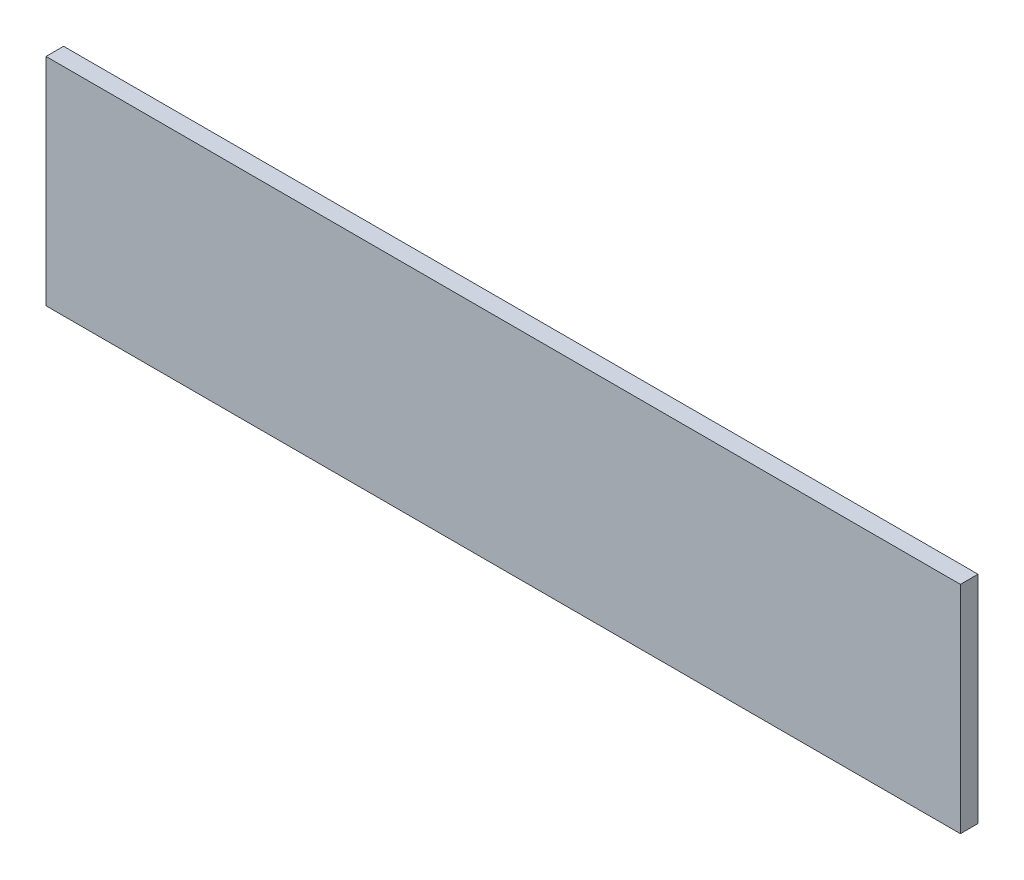
ISO-10303-21;
HEADER;
FILE_DESCRIPTION(('STEP AP214'),'2;1');
FILE_NAME('part.step','',(''),(''),'','','');
FILE_SCHEMA(('AUTOMOTIVE_DESIGN { 1 0 10303 214 1 1 1 1 }'));
ENDSEC;
DATA;
#1=APPLICATION_CONTEXT('core data for automotive mechanical design processes');
#2=APPLICATION_PROTOCOL_DEFINITION('international standard','automotive_design',2000,#1);
#3=PRODUCT_CONTEXT('',#1,'mechanical');
#4=PRODUCT('Part','Part','',(#3));
#5=PRODUCT_RELATED_PRODUCT_CATEGORY('part','',(#4));
#6=PRODUCT_DEFINITION_FORMATION('','',#4);
#7=PRODUCT_DEFINITION_CONTEXT('part definition',#1,'design');
#8=PRODUCT_DEFINITION('design','',#6,#7);
#9=PRODUCT_DEFINITION_SHAPE('','',#8);
#10=(LENGTH_UNIT() NAMED_UNIT(*) SI_UNIT(.MILLI.,.METRE.));
#11=(NAMED_UNIT(*) PLANE_ANGLE_UNIT() SI_UNIT($,.RADIAN.));
#12=(NAMED_UNIT(*) SI_UNIT($,.STERADIAN.) SOLID_ANGLE_UNIT());
#13=UNCERTAINTY_MEASURE_WITH_UNIT(LENGTH_MEASURE(1.E-05),#10,'distance_accuracy_value','');
#14=(GEOMETRIC_REPRESENTATION_CONTEXT(3) GLOBAL_UNCERTAINTY_ASSIGNED_CONTEXT((#13)) GLOBAL_UNIT_ASSIGNED_CONTEXT((#10,
#11,#12)) REPRESENTATION_CONTEXT('',''));
#15=CARTESIAN_POINT('',(0.,0.,0.));
#16=DIRECTION('',(0.,0.,1.));
#17=DIRECTION('',(1.,0.,0.));
#18=AXIS2_PLACEMENT_3D('',#15,#16,#17);
#19=CARTESIAN_POINT('',(-130.184670884671,-33.4551039462644,5.));
#20=DIRECTION('',(0.,1.,0.));
#21=DIRECTION('',(0.,0.,1.));
#22=AXIS2_PLACEMENT_3D('',#19,#20,#21);
#23=PLANE('',#22);
#24=DIRECTION('',(1.,0.,0.));
#25=VECTOR('',#24,1.);
#26=CARTESIAN_POINT('',(-130.184670884671,-33.4551039462644,0.));
#27=LINE('',#26,#25);
#28=CARTESIAN_POINT('',(-130.184670884671,-33.4551039462644,0.));
#29=VERTEX_POINT('',#28);
#30=CARTESIAN_POINT('',(129.81532911533,-33.4551039462644,0.));
#31=VERTEX_POINT('',#30);
#32=EDGE_CURVE('E96',#29,#31,#27,.T.);
#33=ORIENTED_EDGE('',*,*,#32,.T.);
#34=DIRECTION('',(0.,0.,-1.));
#35=VECTOR('',#34,1.);
#36=CARTESIAN_POINT('',(129.81532911533,-33.4551039462644,5.));
#37=LINE('',#36,#35);
#38=CARTESIAN_POINT('',(129.81532911533,-33.4551039462644,5.));
#39=VERTEX_POINT('',#38);
#40=EDGE_CURVE('E11',#39,#31,#37,.T.);
#41=ORIENTED_EDGE('',*,*,#40,.F.);
#42=DIRECTION('',(1.,0.,0.));
#43=VECTOR('',#42,1.);
#44=CARTESIAN_POINT('',(-130.184670884671,-33.4551039462644,5.));
#45=LINE('',#44,#43);
#46=CARTESIAN_POINT('',(-130.184670884671,-33.4551039462644,5.));
#47=VERTEX_POINT('',#46);
#48=EDGE_CURVE('E84',#47,#39,#45,.T.);
#49=ORIENTED_EDGE('',*,*,#48,.F.);
#50=DIRECTION('',(0.,0.,-1.));
#51=VECTOR('',#50,1.);
#52=CARTESIAN_POINT('',(-130.184670884671,-33.4551039462644,5.));
#53=LINE('',#52,#51);
#54=EDGE_CURVE('E92',#47,#29,#53,.T.);
#55=ORIENTED_EDGE('',*,*,#54,.T.);
#56=EDGE_LOOP('',(#33,#41,#49,#55));
#57=FACE_BOUND('',#56,.T.);
#58=ADVANCED_FACE('F33',(#57),#23,.F.);
#59=CARTESIAN_POINT('',(129.81532911533,27.951840543001,5.));
#60=DIRECTION('',(-1.,0.,0.));
#61=DIRECTION('',(0.,0.,1.));
#62=AXIS2_PLACEMENT_3D('',#59,#60,#61);
#63=PLANE('',#62);
#64=DIRECTION('',(0.,1.,0.));
#65=VECTOR('',#64,1.);
#66=CARTESIAN_POINT('',(129.81532911533,27.951840543001,0.));
#67=LINE('',#66,#65);
#68=CARTESIAN_POINT('',(129.81532911533,27.951840543001,0.));
#69=VERTEX_POINT('',#68);
#70=EDGE_CURVE('E88',#31,#69,#67,.T.);
#71=ORIENTED_EDGE('',*,*,#70,.T.);
#72=DIRECTION('',(0.,0.,-1.));
#73=VECTOR('',#72,1.);
#74=CARTESIAN_POINT('',(129.81532911533,27.951840543001,5.));
#75=LINE('',#74,#73);
#76=CARTESIAN_POINT('',(129.81532911533,27.951840543001,5.));
#77=VERTEX_POINT('',#76);
#78=EDGE_CURVE('E41',#77,#69,#75,.T.);
#79=ORIENTED_EDGE('',*,*,#78,.F.);
#80=DIRECTION('',(0.,1.,0.));
#81=VECTOR('',#80,1.);
#82=CARTESIAN_POINT('',(129.81532911533,27.951840543001,5.));
#83=LINE('',#82,#81);
#84=EDGE_CURVE('E79',#39,#77,#83,.T.);
#85=ORIENTED_EDGE('',*,*,#84,.F.);
#86=ORIENTED_EDGE('',*,*,#40,.T.);
#87=EDGE_LOOP('',(#71,#79,#85,#86));
#88=FACE_BOUND('',#87,.T.);
#89=ADVANCED_FACE('F87',(#88),#63,.F.);
#90=CARTESIAN_POINT('',(-130.184670884671,27.951840543001,5.));
#91=DIRECTION('',(0.,-1.,0.));
#92=DIRECTION('',(0.,0.,-1.));
#93=AXIS2_PLACEMENT_3D('',#90,#91,#92);
#94=PLANE('',#93);
#95=DIRECTION('',(-1.,0.,0.));
#96=VECTOR('',#95,1.);
#97=CARTESIAN_POINT('',(-130.184670884671,27.951840543001,0.));
#98=LINE('',#97,#96);
#99=CARTESIAN_POINT('',(-130.184670884671,27.951840543001,0.));
#100=VERTEX_POINT('',#99);
#101=EDGE_CURVE('E66',#69,#100,#98,.T.);
#102=ORIENTED_EDGE('',*,*,#101,.T.);
#103=DIRECTION('',(0.,0.,-1.));
#104=VECTOR('',#103,1.);
#105=CARTESIAN_POINT('',(-130.184670884671,27.951840543001,5.));
#106=LINE('',#105,#104);
#107=CARTESIAN_POINT('',(-130.184670884671,27.951840543001,5.));
#108=VERTEX_POINT('',#107);
#109=EDGE_CURVE('E89',#108,#100,#106,.T.);
#110=ORIENTED_EDGE('',*,*,#109,.F.);
#111=DIRECTION('',(-1.,0.,0.));
#112=VECTOR('',#111,1.);
#113=CARTESIAN_POINT('',(-130.184670884671,27.951840543001,5.));
#114=LINE('',#113,#112);
#115=EDGE_CURVE('E82',#77,#108,#114,.T.);
#116=ORIENTED_EDGE('',*,*,#115,.F.);
#117=ORIENTED_EDGE('',*,*,#78,.T.);
#118=EDGE_LOOP('',(#102,#110,#116,#117));
#119=FACE_BOUND('',#118,.T.);
#120=ADVANCED_FACE('F90',(#119),#94,.F.);
#121=CARTESIAN_POINT('',(-130.184670884671,27.951840543001,5.));
#122=DIRECTION('',(1.,0.,0.));
#123=DIRECTION('',(0.,0.,-1.));
#124=AXIS2_PLACEMENT_3D('',#121,#122,#123);
#125=PLANE('',#124);
#126=DIRECTION('',(0.,-1.,0.));
#127=VECTOR('',#126,1.);
#128=CARTESIAN_POINT('',(-130.184670884671,27.951840543001,0.));
#129=LINE('',#128,#127);
#130=EDGE_CURVE('E72',#100,#29,#129,.T.);
#131=ORIENTED_EDGE('',*,*,#130,.T.);
#132=ORIENTED_EDGE('',*,*,#54,.F.);
#133=DIRECTION('',(0.,-1.,0.));
#134=VECTOR('',#133,1.);
#135=CARTESIAN_POINT('',(-130.184670884671,27.951840543001,5.));
#136=LINE('',#135,#134);
#137=EDGE_CURVE('E49',#108,#47,#136,.T.);
#138=ORIENTED_EDGE('',*,*,#137,.F.);
#139=ORIENTED_EDGE('',*,*,#109,.T.);
#140=EDGE_LOOP('',(#131,#132,#138,#139));
#141=FACE_BOUND('',#140,.T.);
#142=ADVANCED_FACE('F103',(#141),#125,.F.);
#143=CARTESIAN_POINT('',(0.,0.,5.));
#144=DIRECTION('',(0.,0.,-1.));
#145=DIRECTION('',(-1.,0.,0.));
#146=AXIS2_PLACEMENT_3D('',#143,#144,#145);
#147=PLANE('',#146);
#148=ORIENTED_EDGE('',*,*,#48,.T.);
#149=ORIENTED_EDGE('',*,*,#84,.T.);
#150=ORIENTED_EDGE('',*,*,#115,.T.);
#151=ORIENTED_EDGE('',*,*,#137,.T.);
#152=EDGE_LOOP('',(#148,#149,#150,#151));
#153=FACE_BOUND('',#152,.T.);
#154=ADVANCED_FACE('F80',(#153),#147,.F.);
#155=CARTESIAN_POINT('',(0.,0.,0.));
#156=DIRECTION('',(0.,0.,-1.));
#157=DIRECTION('',(-1.,0.,0.));
#158=AXIS2_PLACEMENT_3D('',#155,#156,#157);
#159=PLANE('',#158);
#160=ORIENTED_EDGE('',*,*,#32,.F.);
#161=ORIENTED_EDGE('',*,*,#130,.F.);
#162=ORIENTED_EDGE('',*,*,#101,.F.);
#163=ORIENTED_EDGE('',*,*,#70,.F.);
#164=EDGE_LOOP('',(#160,#161,#162,#163));
#165=FACE_BOUND('',#164,.T.);
#166=ADVANCED_FACE('F106',(#165),#159,.T.);
#167=CLOSED_SHELL('',(#58,#89,#120,#142,#154,#166));
#168=MANIFOLD_SOLID_BREP('B2',#167);
#169=ADVANCED_BREP_SHAPE_REPRESENTATION('',(#18,#168),#14);
#170=SHAPE_DEFINITION_REPRESENTATION(#9,#169);
ENDSEC;
END-ISO-10303-21;
